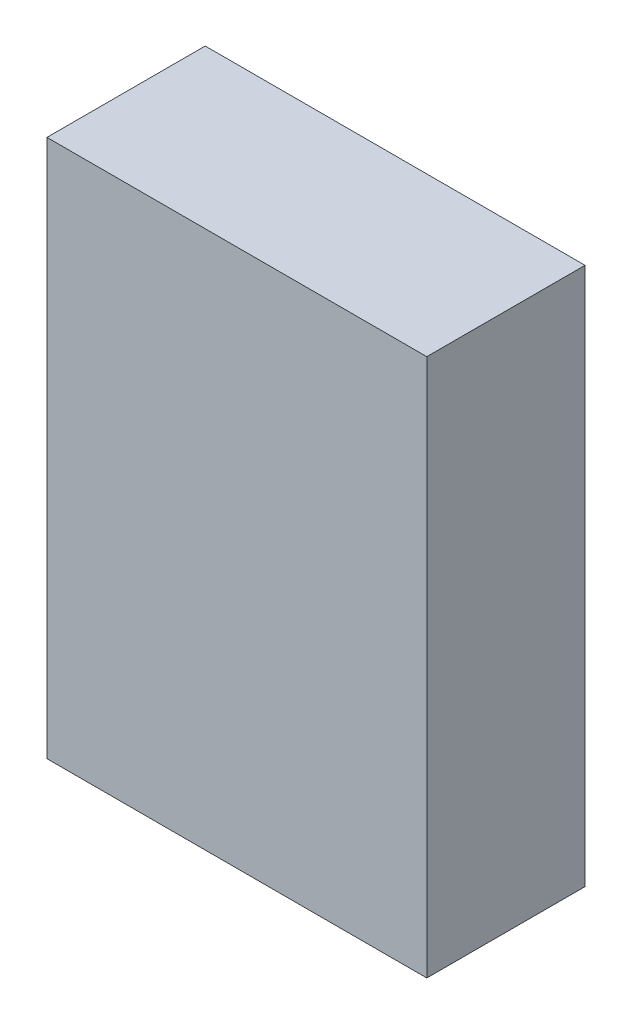
ISO-10303-21;
HEADER;
FILE_DESCRIPTION(('STEP AP214'),'2;1');
FILE_NAME('part.step','',(''),(''),'','','');
FILE_SCHEMA(('AUTOMOTIVE_DESIGN { 1 0 10303 214 1 1 1 1 }'));
ENDSEC;
DATA;
#1=APPLICATION_CONTEXT('core data for automotive mechanical design processes');
#2=APPLICATION_PROTOCOL_DEFINITION('international standard','automotive_design',2000,#1);
#3=PRODUCT_CONTEXT('',#1,'mechanical');
#4=PRODUCT('Part','Part','',(#3));
#5=PRODUCT_RELATED_PRODUCT_CATEGORY('part','',(#4));
#6=PRODUCT_DEFINITION_FORMATION('','',#4);
#7=PRODUCT_DEFINITION_CONTEXT('part definition',#1,'design');
#8=PRODUCT_DEFINITION('design','',#6,#7);
#9=PRODUCT_DEFINITION_SHAPE('','',#8);
#10=(LENGTH_UNIT() NAMED_UNIT(*) SI_UNIT(.MILLI.,.METRE.));
#11=(NAMED_UNIT(*) PLANE_ANGLE_UNIT() SI_UNIT($,.RADIAN.));
#12=(NAMED_UNIT(*) SI_UNIT($,.STERADIAN.) SOLID_ANGLE_UNIT());
#13=UNCERTAINTY_MEASURE_WITH_UNIT(LENGTH_MEASURE(1.E-05),#10,'distance_accuracy_value','');
#14=(GEOMETRIC_REPRESENTATION_CONTEXT(3) GLOBAL_UNCERTAINTY_ASSIGNED_CONTEXT((#13)) GLOBAL_UNIT_ASSIGNED_CONTEXT((#10,
#11,#12)) REPRESENTATION_CONTEXT('',''));
#15=CARTESIAN_POINT('',(0.,0.,0.));
#16=DIRECTION('',(0.,0.,1.));
#17=DIRECTION('',(1.,0.,0.));
#18=AXIS2_PLACEMENT_3D('',#15,#16,#17);
#19=CARTESIAN_POINT('',(-0.37,2.58,0.));
#20=DIRECTION('',(1.,0.,0.));
#21=DIRECTION('',(0.,0.,1.));
#22=AXIS2_PLACEMENT_3D('',#19,#20,#21);
#23=PLANE('',#22);
#24=DIRECTION('',(0.,1.,0.));
#25=VECTOR('',#24,1.);
#26=CARTESIAN_POINT('',(-0.37,2.58,0.1));
#27=LINE('',#26,#25);
#28=CARTESIAN_POINT('',(-0.37,2.58,0.1));
#29=VERTEX_POINT('',#28);
#30=CARTESIAN_POINT('',(-0.37,2.92,0.1));
#31=VERTEX_POINT('',#30);
#32=EDGE_CURVE('E11',#29,#31,#27,.T.);
#33=ORIENTED_EDGE('',*,*,#32,.T.);
#34=DIRECTION('',(0.,0.,1.));
#35=VECTOR('',#34,1.);
#36=CARTESIAN_POINT('',(-0.37,2.92,0.));
#37=LINE('',#36,#35);
#38=CARTESIAN_POINT('',(-0.37,2.92,0.));
#39=VERTEX_POINT('',#38);
#40=EDGE_CURVE('E24',#39,#31,#37,.T.);
#41=ORIENTED_EDGE('',*,*,#40,.F.);
#42=DIRECTION('',(0.,1.,0.));
#43=VECTOR('',#42,1.);
#44=CARTESIAN_POINT('',(-0.37,2.58,0.));
#45=LINE('',#44,#43);
#46=CARTESIAN_POINT('',(-0.37,2.58,0.));
#47=VERTEX_POINT('',#46);
#48=EDGE_CURVE('E86',#47,#39,#45,.T.);
#49=ORIENTED_EDGE('',*,*,#48,.F.);
#50=DIRECTION('',(0.,0.,1.));
#51=VECTOR('',#50,1.);
#52=CARTESIAN_POINT('',(-0.37,2.58,0.));
#53=LINE('',#52,#51);
#54=EDGE_CURVE('E36',#47,#29,#53,.T.);
#55=ORIENTED_EDGE('',*,*,#54,.T.);
#56=EDGE_LOOP('',(#33,#41,#49,#55));
#57=FACE_BOUND('',#56,.T.);
#58=ADVANCED_FACE('F17',(#57),#23,.F.);
#59=CARTESIAN_POINT('',(-0.13,2.58,0.));
#60=DIRECTION('',(1.,0.,0.));
#61=DIRECTION('',(0.,0.,1.));
#62=AXIS2_PLACEMENT_3D('',#59,#60,#61);
#63=PLANE('',#62);
#64=DIRECTION('',(0.,0.,1.));
#65=VECTOR('',#64,1.);
#66=CARTESIAN_POINT('',(-0.13,2.58,0.));
#67=LINE('',#66,#65);
#68=CARTESIAN_POINT('',(-0.13,2.58,0.));
#69=VERTEX_POINT('',#68);
#70=CARTESIAN_POINT('',(-0.13,2.58,0.1));
#71=VERTEX_POINT('',#70);
#72=EDGE_CURVE('E83',#69,#71,#67,.T.);
#73=ORIENTED_EDGE('',*,*,#72,.F.);
#74=DIRECTION('',(0.,1.,0.));
#75=VECTOR('',#74,1.);
#76=CARTESIAN_POINT('',(-0.13,2.58,0.));
#77=LINE('',#76,#75);
#78=CARTESIAN_POINT('',(-0.13,2.92,0.));
#79=VERTEX_POINT('',#78);
#80=EDGE_CURVE('E63',#69,#79,#77,.T.);
#81=ORIENTED_EDGE('',*,*,#80,.T.);
#82=DIRECTION('',(0.,0.,1.));
#83=VECTOR('',#82,1.);
#84=CARTESIAN_POINT('',(-0.13,2.92,0.));
#85=LINE('',#84,#83);
#86=CARTESIAN_POINT('',(-0.13,2.92,0.1));
#87=VERTEX_POINT('',#86);
#88=EDGE_CURVE('E57',#79,#87,#85,.T.);
#89=ORIENTED_EDGE('',*,*,#88,.T.);
#90=DIRECTION('',(0.,1.,0.));
#91=VECTOR('',#90,1.);
#92=CARTESIAN_POINT('',(-0.13,2.58,0.1));
#93=LINE('',#92,#91);
#94=EDGE_CURVE('E60',#71,#87,#93,.T.);
#95=ORIENTED_EDGE('',*,*,#94,.F.);
#96=EDGE_LOOP('',(#73,#81,#89,#95));
#97=FACE_BOUND('',#96,.T.);
#98=ADVANCED_FACE('F59',(#97),#63,.T.);
#99=CARTESIAN_POINT('',(-0.37,2.58,0.));
#100=DIRECTION('',(0.,1.,0.));
#101=DIRECTION('',(0.,0.,1.));
#102=AXIS2_PLACEMENT_3D('',#99,#100,#101);
#103=PLANE('',#102);
#104=ORIENTED_EDGE('',*,*,#72,.T.);
#105=DIRECTION('',(1.,0.,0.));
#106=VECTOR('',#105,1.);
#107=CARTESIAN_POINT('',(-0.37,2.58,0.1));
#108=LINE('',#107,#106);
#109=EDGE_CURVE('E71',#29,#71,#108,.T.);
#110=ORIENTED_EDGE('',*,*,#109,.F.);
#111=ORIENTED_EDGE('',*,*,#54,.F.);
#112=DIRECTION('',(1.,0.,0.));
#113=VECTOR('',#112,1.);
#114=CARTESIAN_POINT('',(-0.37,2.58,0.));
#115=LINE('',#114,#113);
#116=EDGE_CURVE('E76',#47,#69,#115,.T.);
#117=ORIENTED_EDGE('',*,*,#116,.T.);
#118=EDGE_LOOP('',(#104,#110,#111,#117));
#119=FACE_BOUND('',#118,.T.);
#120=ADVANCED_FACE('F91',(#119),#103,.F.);
#121=CARTESIAN_POINT('',(-0.37,2.92,0.));
#122=DIRECTION('',(0.,1.,0.));
#123=DIRECTION('',(0.,0.,1.));
#124=AXIS2_PLACEMENT_3D('',#121,#122,#123);
#125=PLANE('',#124);
#126=DIRECTION('',(1.,0.,0.));
#127=VECTOR('',#126,1.);
#128=CARTESIAN_POINT('',(-0.37,2.92,0.));
#129=LINE('',#128,#127);
#130=EDGE_CURVE('E74',#39,#79,#129,.T.);
#131=ORIENTED_EDGE('',*,*,#130,.F.);
#132=ORIENTED_EDGE('',*,*,#40,.T.);
#133=DIRECTION('',(1.,0.,0.));
#134=VECTOR('',#133,1.);
#135=CARTESIAN_POINT('',(-0.37,2.92,0.1));
#136=LINE('',#135,#134);
#137=EDGE_CURVE('E69',#31,#87,#136,.T.);
#138=ORIENTED_EDGE('',*,*,#137,.T.);
#139=ORIENTED_EDGE('',*,*,#88,.F.);
#140=EDGE_LOOP('',(#131,#132,#138,#139));
#141=FACE_BOUND('',#140,.T.);
#142=ADVANCED_FACE('F73',(#141),#125,.T.);
#143=CARTESIAN_POINT('',(-0.37,2.58,0.));
#144=DIRECTION('',(0.,0.,1.));
#145=DIRECTION('',(1.,0.,0.));
#146=AXIS2_PLACEMENT_3D('',#143,#144,#145);
#147=PLANE('',#146);
#148=ORIENTED_EDGE('',*,*,#130,.T.);
#149=ORIENTED_EDGE('',*,*,#80,.F.);
#150=ORIENTED_EDGE('',*,*,#116,.F.);
#151=ORIENTED_EDGE('',*,*,#48,.T.);
#152=EDGE_LOOP('',(#148,#149,#150,#151));
#153=FACE_BOUND('',#152,.T.);
#154=ADVANCED_FACE('F89',(#153),#147,.F.);
#155=CARTESIAN_POINT('',(-0.37,2.58,0.1));
#156=DIRECTION('',(0.,0.,1.));
#157=DIRECTION('',(1.,0.,0.));
#158=AXIS2_PLACEMENT_3D('',#155,#156,#157);
#159=PLANE('',#158);
#160=ORIENTED_EDGE('',*,*,#32,.F.);
#161=ORIENTED_EDGE('',*,*,#109,.T.);
#162=ORIENTED_EDGE('',*,*,#94,.T.);
#163=ORIENTED_EDGE('',*,*,#137,.F.);
#164=EDGE_LOOP('',(#160,#161,#162,#163));
#165=FACE_BOUND('',#164,.T.);
#166=ADVANCED_FACE('F68',(#165),#159,.T.);
#167=CLOSED_SHELL('',(#58,#98,#120,#142,#154,#166));
#168=MANIFOLD_SOLID_BREP('B1',#167);
#169=ADVANCED_BREP_SHAPE_REPRESENTATION('',(#18,#168),#14);
#170=SHAPE_DEFINITION_REPRESENTATION(#9,#169);
ENDSEC;
END-ISO-10303-21;
